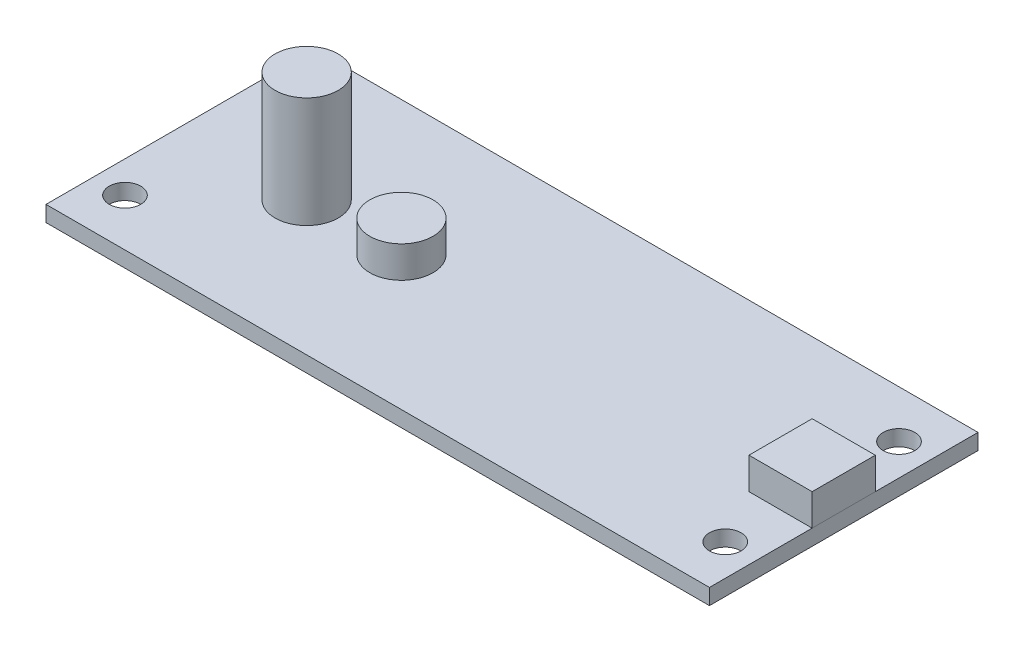
ISO-10303-21;
HEADER;
FILE_DESCRIPTION(('STEP AP214'),'2;1');
FILE_NAME('part.step','',(''),(''),'','','');
FILE_SCHEMA(('AUTOMOTIVE_DESIGN { 1 0 10303 214 1 1 1 1 }'));
ENDSEC;
DATA;
#1=APPLICATION_CONTEXT('core data for automotive mechanical design processes');
#2=APPLICATION_PROTOCOL_DEFINITION('international standard','automotive_design',2000,#1);
#3=PRODUCT_CONTEXT('',#1,'mechanical');
#4=PRODUCT('Part','Part','',(#3));
#5=PRODUCT_RELATED_PRODUCT_CATEGORY('part','',(#4));
#6=PRODUCT_DEFINITION_FORMATION('','',#4);
#7=PRODUCT_DEFINITION_CONTEXT('part definition',#1,'design');
#8=PRODUCT_DEFINITION('design','',#6,#7);
#9=PRODUCT_DEFINITION_SHAPE('','',#8);
#10=(LENGTH_UNIT() NAMED_UNIT(*) SI_UNIT(.MILLI.,.METRE.));
#11=(NAMED_UNIT(*) PLANE_ANGLE_UNIT() SI_UNIT($,.RADIAN.));
#12=(NAMED_UNIT(*) SI_UNIT($,.STERADIAN.) SOLID_ANGLE_UNIT());
#13=UNCERTAINTY_MEASURE_WITH_UNIT(LENGTH_MEASURE(1.E-05),#10,'distance_accuracy_value','');
#14=(GEOMETRIC_REPRESENTATION_CONTEXT(3) GLOBAL_UNCERTAINTY_ASSIGNED_CONTEXT((#13)) GLOBAL_UNIT_ASSIGNED_CONTEXT((#10,
#11,#12)) REPRESENTATION_CONTEXT('',''));
#15=CARTESIAN_POINT('',(0.,0.,0.));
#16=DIRECTION('',(0.,0.,1.));
#17=DIRECTION('',(1.,0.,0.));
#18=AXIS2_PLACEMENT_3D('',#15,#16,#17);
#19=CARTESIAN_POINT('',(-11.1125,4.7625,0.));
#20=DIRECTION('',(0.,-1.,0.));
#21=DIRECTION('',(0.,0.,-1.));
#22=AXIS2_PLACEMENT_3D('',#19,#20,#21);
#23=CYLINDRICAL_SURFACE('',#22,3.175);
#24=CARTESIAN_POINT('',(-11.1125,4.7625,0.));
#25=DIRECTION('',(0.,1.,0.));
#26=DIRECTION('',(0.,0.,1.));
#27=AXIS2_PLACEMENT_3D('',#24,#25,#26);
#28=CIRCLE('',#27,3.175);
#29=CARTESIAN_POINT('',(-11.1125,4.7625,3.175));
#30=VERTEX_POINT('',#29);
#31=EDGE_CURVE('E11',#30,#30,#28,.T.);
#32=ORIENTED_EDGE('',*,*,#31,.F.);
#33=EDGE_LOOP('',(#32));
#34=FACE_BOUND('',#33,.T.);
#35=CARTESIAN_POINT('',(-11.1125,1.5875,0.));
#36=DIRECTION('',(0.,1.,0.));
#37=DIRECTION('',(0.,0.,1.));
#38=AXIS2_PLACEMENT_3D('',#35,#36,#37);
#39=CIRCLE('',#38,3.175);
#40=CARTESIAN_POINT('',(-11.1125,1.5875,3.175));
#41=VERTEX_POINT('',#40);
#42=EDGE_CURVE('E46',#41,#41,#39,.T.);
#43=ORIENTED_EDGE('',*,*,#42,.T.);
#44=EDGE_LOOP('',(#43));
#45=FACE_BOUND('',#44,.T.);
#46=ADVANCED_FACE('F43',(#34,#45),#23,.T.);
#47=CARTESIAN_POINT('',(-11.1125,4.7625,0.));
#48=DIRECTION('',(0.,1.,0.));
#49=DIRECTION('',(0.,0.,1.));
#50=AXIS2_PLACEMENT_3D('',#47,#48,#49);
#51=PLANE('',#50);
#52=ORIENTED_EDGE('',*,*,#31,.T.);
#53=EDGE_LOOP('',(#52));
#54=FACE_BOUND('',#53,.T.);
#55=ADVANCED_FACE('F58',(#54),#51,.T.);
#56=CARTESIAN_POINT('',(-11.1125,1.5875,0.));
#57=DIRECTION('',(0.,1.,0.));
#58=DIRECTION('',(0.,0.,1.));
#59=AXIS2_PLACEMENT_3D('',#56,#57,#58);
#60=PLANE('',#59);
#61=ORIENTED_EDGE('',*,*,#42,.F.);
#62=EDGE_LOOP('',(#61));
#63=FACE_BOUND('',#62,.T.);
#64=ADVANCED_FACE('F56',(#63),#60,.F.);
#65=CLOSED_SHELL('',(#46,#55,#64));
#66=MANIFOLD_SOLID_BREP('B2',#65);
#67=CARTESIAN_POINT('',(33.3375,4.7625,-3.175));
#68=DIRECTION('',(-1.,0.,0.));
#69=DIRECTION('',(0.,0.,1.));
#70=AXIS2_PLACEMENT_3D('',#67,#68,#69);
#71=PLANE('',#70);
#72=DIRECTION('',(0.,0.,-1.));
#73=VECTOR('',#72,1.);
#74=CARTESIAN_POINT('',(33.3375,1.5875,-3.175));
#75=LINE('',#74,#73);
#76=CARTESIAN_POINT('',(33.3375,1.5875,3.175));
#77=VERTEX_POINT('',#76);
#78=CARTESIAN_POINT('',(33.3375,1.5875,-3.175));
#79=VERTEX_POINT('',#78);
#80=EDGE_CURVE('E154',#77,#79,#75,.T.);
#81=ORIENTED_EDGE('',*,*,#80,.T.);
#82=DIRECTION('',(0.,-1.,0.));
#83=VECTOR('',#82,1.);
#84=CARTESIAN_POINT('',(33.3375,4.7625,-3.175));
#85=LINE('',#84,#83);
#86=CARTESIAN_POINT('',(33.3375,4.7625,-3.175));
#87=VERTEX_POINT('',#86);
#88=EDGE_CURVE('E41',#87,#79,#85,.T.);
#89=ORIENTED_EDGE('',*,*,#88,.F.);
#90=DIRECTION('',(0.,0.,-1.));
#91=VECTOR('',#90,1.);
#92=CARTESIAN_POINT('',(33.3375,4.7625,-3.175));
#93=LINE('',#92,#91);
#94=CARTESIAN_POINT('',(33.3375,4.7625,3.175));
#95=VERTEX_POINT('',#94);
#96=EDGE_CURVE('E142',#95,#87,#93,.T.);
#97=ORIENTED_EDGE('',*,*,#96,.F.);
#98=DIRECTION('',(0.,-1.,0.));
#99=VECTOR('',#98,1.);
#100=CARTESIAN_POINT('',(33.3375,4.7625,3.175));
#101=LINE('',#100,#99);
#102=EDGE_CURVE('E150',#95,#77,#101,.T.);
#103=ORIENTED_EDGE('',*,*,#102,.T.);
#104=EDGE_LOOP('',(#81,#89,#97,#103));
#105=FACE_BOUND('',#104,.T.);
#106=ADVANCED_FACE('F91',(#105),#71,.F.);
#107=CARTESIAN_POINT('',(33.3375,4.7625,-3.175));
#108=DIRECTION('',(0.,0.,1.));
#109=DIRECTION('',(1.,0.,0.));
#110=AXIS2_PLACEMENT_3D('',#107,#108,#109);
#111=PLANE('',#110);
#112=DIRECTION('',(-1.,0.,0.));
#113=VECTOR('',#112,1.);
#114=CARTESIAN_POINT('',(33.3375,1.5875,-3.175));
#115=LINE('',#114,#113);
#116=CARTESIAN_POINT('',(26.9875,1.5875,-3.175));
#117=VERTEX_POINT('',#116);
#118=EDGE_CURVE('E146',#79,#117,#115,.T.);
#119=ORIENTED_EDGE('',*,*,#118,.T.);
#120=DIRECTION('',(0.,-1.,0.));
#121=VECTOR('',#120,1.);
#122=CARTESIAN_POINT('',(26.9875,4.7625,-3.175));
#123=LINE('',#122,#121);
#124=CARTESIAN_POINT('',(26.9875,4.7625,-3.175));
#125=VERTEX_POINT('',#124);
#126=EDGE_CURVE('E99',#125,#117,#123,.T.);
#127=ORIENTED_EDGE('',*,*,#126,.F.);
#128=DIRECTION('',(-1.,0.,0.));
#129=VECTOR('',#128,1.);
#130=CARTESIAN_POINT('',(33.3375,4.7625,-3.175));
#131=LINE('',#130,#129);
#132=EDGE_CURVE('E137',#87,#125,#131,.T.);
#133=ORIENTED_EDGE('',*,*,#132,.F.);
#134=ORIENTED_EDGE('',*,*,#88,.T.);
#135=EDGE_LOOP('',(#119,#127,#133,#134));
#136=FACE_BOUND('',#135,.T.);
#137=ADVANCED_FACE('F145',(#136),#111,.F.);
#138=CARTESIAN_POINT('',(26.9875,4.7625,-3.175));
#139=DIRECTION('',(1.,0.,0.));
#140=DIRECTION('',(0.,0.,-1.));
#141=AXIS2_PLACEMENT_3D('',#138,#139,#140);
#142=PLANE('',#141);
#143=DIRECTION('',(0.,0.,1.));
#144=VECTOR('',#143,1.);
#145=CARTESIAN_POINT('',(26.9875,1.5875,-3.175));
#146=LINE('',#145,#144);
#147=CARTESIAN_POINT('',(26.9875,1.5875,3.175));
#148=VERTEX_POINT('',#147);
#149=EDGE_CURVE('E124',#117,#148,#146,.T.);
#150=ORIENTED_EDGE('',*,*,#149,.T.);
#151=DIRECTION('',(0.,-1.,0.));
#152=VECTOR('',#151,1.);
#153=CARTESIAN_POINT('',(26.9875,4.7625,3.175));
#154=LINE('',#153,#152);
#155=CARTESIAN_POINT('',(26.9875,4.7625,3.175));
#156=VERTEX_POINT('',#155);
#157=EDGE_CURVE('E147',#156,#148,#154,.T.);
#158=ORIENTED_EDGE('',*,*,#157,.F.);
#159=DIRECTION('',(0.,0.,1.));
#160=VECTOR('',#159,1.);
#161=CARTESIAN_POINT('',(26.9875,4.7625,-3.175));
#162=LINE('',#161,#160);
#163=EDGE_CURVE('E140',#125,#156,#162,.T.);
#164=ORIENTED_EDGE('',*,*,#163,.F.);
#165=ORIENTED_EDGE('',*,*,#126,.T.);
#166=EDGE_LOOP('',(#150,#158,#164,#165));
#167=FACE_BOUND('',#166,.T.);
#168=ADVANCED_FACE('F148',(#167),#142,.F.);
#169=CARTESIAN_POINT('',(33.3375,4.7625,3.175));
#170=DIRECTION('',(0.,0.,-1.));
#171=DIRECTION('',(-1.,0.,0.));
#172=AXIS2_PLACEMENT_3D('',#169,#170,#171);
#173=PLANE('',#172);
#174=DIRECTION('',(1.,0.,0.));
#175=VECTOR('',#174,1.);
#176=CARTESIAN_POINT('',(33.3375,1.5875,3.175));
#177=LINE('',#176,#175);
#178=EDGE_CURVE('E130',#148,#77,#177,.T.);
#179=ORIENTED_EDGE('',*,*,#178,.T.);
#180=ORIENTED_EDGE('',*,*,#102,.F.);
#181=DIRECTION('',(1.,0.,0.));
#182=VECTOR('',#181,1.);
#183=CARTESIAN_POINT('',(33.3375,4.7625,3.175));
#184=LINE('',#183,#182);
#185=EDGE_CURVE('E107',#156,#95,#184,.T.);
#186=ORIENTED_EDGE('',*,*,#185,.F.);
#187=ORIENTED_EDGE('',*,*,#157,.T.);
#188=EDGE_LOOP('',(#179,#180,#186,#187));
#189=FACE_BOUND('',#188,.T.);
#190=ADVANCED_FACE('F161',(#189),#173,.F.);
#191=CARTESIAN_POINT('',(0.,4.7625,0.));
#192=DIRECTION('',(0.,-1.,0.));
#193=DIRECTION('',(0.,0.,-1.));
#194=AXIS2_PLACEMENT_3D('',#191,#192,#193);
#195=PLANE('',#194);
#196=ORIENTED_EDGE('',*,*,#96,.T.);
#197=ORIENTED_EDGE('',*,*,#132,.T.);
#198=ORIENTED_EDGE('',*,*,#163,.T.);
#199=ORIENTED_EDGE('',*,*,#185,.T.);
#200=EDGE_LOOP('',(#196,#197,#198,#199));
#201=FACE_BOUND('',#200,.T.);
#202=ADVANCED_FACE('F138',(#201),#195,.F.);
#203=CARTESIAN_POINT('',(0.,1.5875,0.));
#204=DIRECTION('',(0.,-1.,0.));
#205=DIRECTION('',(0.,0.,-1.));
#206=AXIS2_PLACEMENT_3D('',#203,#204,#205);
#207=PLANE('',#206);
#208=ORIENTED_EDGE('',*,*,#80,.F.);
#209=ORIENTED_EDGE('',*,*,#178,.F.);
#210=ORIENTED_EDGE('',*,*,#149,.F.);
#211=ORIENTED_EDGE('',*,*,#118,.F.);
#212=EDGE_LOOP('',(#208,#209,#210,#211));
#213=FACE_BOUND('',#212,.T.);
#214=ADVANCED_FACE('F164',(#213),#207,.T.);
#215=CLOSED_SHELL('',(#106,#137,#168,#190,#202,#214));
#216=MANIFOLD_SOLID_BREP('B6',#215);
#217=CARTESIAN_POINT('',(-20.6375,12.7,0.));
#218=DIRECTION('',(0.,-1.,0.));
#219=DIRECTION('',(0.,0.,-1.));
#220=AXIS2_PLACEMENT_3D('',#217,#218,#219);
#221=CYLINDRICAL_SURFACE('',#220,3.175);
#222=CARTESIAN_POINT('',(-20.6375,12.7,0.));
#223=DIRECTION('',(0.,1.,0.));
#224=DIRECTION('',(0.,0.,1.));
#225=AXIS2_PLACEMENT_3D('',#222,#223,#224);
#226=CIRCLE('',#225,3.175);
#227=CARTESIAN_POINT('',(-20.6375,12.7,3.175));
#228=VERTEX_POINT('',#227);
#229=EDGE_CURVE('E90',#228,#228,#226,.T.);
#230=ORIENTED_EDGE('',*,*,#229,.F.);
#231=EDGE_LOOP('',(#230));
#232=FACE_BOUND('',#231,.T.);
#233=CARTESIAN_POINT('',(-20.6375,1.5875,0.));
#234=DIRECTION('',(0.,1.,0.));
#235=DIRECTION('',(0.,0.,1.));
#236=AXIS2_PLACEMENT_3D('',#233,#234,#235);
#237=CIRCLE('',#236,3.175);
#238=CARTESIAN_POINT('',(-20.6375,1.5875,3.175));
#239=VERTEX_POINT('',#238);
#240=EDGE_CURVE('E226',#239,#239,#237,.T.);
#241=ORIENTED_EDGE('',*,*,#240,.T.);
#242=EDGE_LOOP('',(#241));
#243=FACE_BOUND('',#242,.T.);
#244=ADVANCED_FACE('F223',(#232,#243),#221,.T.);
#245=CARTESIAN_POINT('',(0.,12.7,0.));
#246=DIRECTION('',(0.,1.,0.));
#247=DIRECTION('',(0.,0.,1.));
#248=AXIS2_PLACEMENT_3D('',#245,#246,#247);
#249=PLANE('',#248);
#250=ORIENTED_EDGE('',*,*,#229,.T.);
#251=EDGE_LOOP('',(#250));
#252=FACE_BOUND('',#251,.T.);
#253=ADVANCED_FACE('F238',(#252),#249,.T.);
#254=CARTESIAN_POINT('',(0.,1.5875,0.));
#255=DIRECTION('',(0.,1.,0.));
#256=DIRECTION('',(0.,0.,1.));
#257=AXIS2_PLACEMENT_3D('',#254,#255,#256);
#258=PLANE('',#257);
#259=ORIENTED_EDGE('',*,*,#240,.F.);
#260=EDGE_LOOP('',(#259));
#261=FACE_BOUND('',#260,.T.);
#262=ADVANCED_FACE('F236',(#261),#258,.F.);
#263=CLOSED_SHELL('',(#244,#253,#262));
#264=MANIFOLD_SOLID_BREP('B35',#263);
#265=CARTESIAN_POINT('',(33.3375,1.5875,-13.49375));
#266=DIRECTION('',(-1.,0.,0.));
#267=DIRECTION('',(0.,0.,1.));
#268=AXIS2_PLACEMENT_3D('',#265,#266,#267);
#269=PLANE('',#268);
#270=DIRECTION('',(0.,0.,-1.));
#271=VECTOR('',#270,1.);
#272=CARTESIAN_POINT('',(33.3375,0.,-13.49375));
#273=LINE('',#272,#271);
#274=CARTESIAN_POINT('',(33.3375,0.,13.49375));
#275=VERTEX_POINT('',#274);
#276=CARTESIAN_POINT('',(33.3375,0.,-13.49375));
#277=VERTEX_POINT('',#276);
#278=EDGE_CURVE('E326',#275,#277,#273,.T.);
#279=ORIENTED_EDGE('',*,*,#278,.T.);
#280=DIRECTION('',(0.,-1.,0.));
#281=VECTOR('',#280,1.);
#282=CARTESIAN_POINT('',(33.3375,1.5875,-13.49375));
#283=LINE('',#282,#281);
#284=CARTESIAN_POINT('',(33.3375,1.5875,-13.49375));
#285=VERTEX_POINT('',#284);
#286=EDGE_CURVE('E221',#285,#277,#283,.T.);
#287=ORIENTED_EDGE('',*,*,#286,.F.);
#288=DIRECTION('',(0.,0.,-1.));
#289=VECTOR('',#288,1.);
#290=CARTESIAN_POINT('',(33.3375,1.5875,-13.49375));
#291=LINE('',#290,#289);
#292=CARTESIAN_POINT('',(33.3375,1.5875,13.49375));
#293=VERTEX_POINT('',#292);
#294=EDGE_CURVE('E314',#293,#285,#291,.T.);
#295=ORIENTED_EDGE('',*,*,#294,.F.);
#296=DIRECTION('',(0.,-1.,0.));
#297=VECTOR('',#296,1.);
#298=CARTESIAN_POINT('',(33.3375,1.5875,13.49375));
#299=LINE('',#298,#297);
#300=EDGE_CURVE('E322',#293,#275,#299,.T.);
#301=ORIENTED_EDGE('',*,*,#300,.T.);
#302=EDGE_LOOP('',(#279,#287,#295,#301));
#303=FACE_BOUND('',#302,.T.);
#304=ADVANCED_FACE('F263',(#303),#269,.F.);
#305=CARTESIAN_POINT('',(-33.3375,1.5875,-13.49375));
#306=DIRECTION('',(0.,0.,1.));
#307=DIRECTION('',(1.,0.,0.));
#308=AXIS2_PLACEMENT_3D('',#305,#306,#307);
#309=PLANE('',#308);
#310=DIRECTION('',(-1.,0.,0.));
#311=VECTOR('',#310,1.);
#312=CARTESIAN_POINT('',(-33.3375,0.,-13.49375));
#313=LINE('',#312,#311);
#314=CARTESIAN_POINT('',(-33.3375,0.,-13.49375));
#315=VERTEX_POINT('',#314);
#316=EDGE_CURVE('E318',#277,#315,#313,.T.);
#317=ORIENTED_EDGE('',*,*,#316,.T.);
#318=DIRECTION('',(0.,-1.,0.));
#319=VECTOR('',#318,1.);
#320=CARTESIAN_POINT('',(-33.3375,1.5875,-13.49375));
#321=LINE('',#320,#319);
#322=CARTESIAN_POINT('',(-33.3375,1.5875,-13.49375));
#323=VERTEX_POINT('',#322);
#324=EDGE_CURVE('E271',#323,#315,#321,.T.);
#325=ORIENTED_EDGE('',*,*,#324,.F.);
#326=DIRECTION('',(-1.,0.,0.));
#327=VECTOR('',#326,1.);
#328=CARTESIAN_POINT('',(-33.3375,1.5875,-13.49375));
#329=LINE('',#328,#327);
#330=EDGE_CURVE('E309',#285,#323,#329,.T.);
#331=ORIENTED_EDGE('',*,*,#330,.F.);
#332=ORIENTED_EDGE('',*,*,#286,.T.);
#333=EDGE_LOOP('',(#317,#325,#331,#332));
#334=FACE_BOUND('',#333,.T.);
#335=ADVANCED_FACE('F317',(#334),#309,.F.);
#336=CARTESIAN_POINT('',(-33.3375,1.5875,-13.49375));
#337=DIRECTION('',(1.,0.,0.));
#338=DIRECTION('',(0.,0.,-1.));
#339=AXIS2_PLACEMENT_3D('',#336,#337,#338);
#340=PLANE('',#339);
#341=DIRECTION('',(0.,0.,1.));
#342=VECTOR('',#341,1.);
#343=CARTESIAN_POINT('',(-33.3375,0.,-13.49375));
#344=LINE('',#343,#342);
#345=CARTESIAN_POINT('',(-33.3375,0.,13.49375));
#346=VERTEX_POINT('',#345);
#347=EDGE_CURVE('E296',#315,#346,#344,.T.);
#348=ORIENTED_EDGE('',*,*,#347,.T.);
#349=DIRECTION('',(0.,-1.,0.));
#350=VECTOR('',#349,1.);
#351=CARTESIAN_POINT('',(-33.3375,1.5875,13.49375));
#352=LINE('',#351,#350);
#353=CARTESIAN_POINT('',(-33.3375,1.5875,13.49375));
#354=VERTEX_POINT('',#353);
#355=EDGE_CURVE('E319',#354,#346,#352,.T.);
#356=ORIENTED_EDGE('',*,*,#355,.F.);
#357=DIRECTION('',(0.,0.,1.));
#358=VECTOR('',#357,1.);
#359=CARTESIAN_POINT('',(-33.3375,1.5875,-13.49375));
#360=LINE('',#359,#358);
#361=EDGE_CURVE('E312',#323,#354,#360,.T.);
#362=ORIENTED_EDGE('',*,*,#361,.F.);
#363=ORIENTED_EDGE('',*,*,#324,.T.);
#364=EDGE_LOOP('',(#348,#356,#362,#363));
#365=FACE_BOUND('',#364,.T.);
#366=ADVANCED_FACE('F320',(#365),#340,.F.);
#367=CARTESIAN_POINT('',(-33.3375,1.5875,13.49375));
#368=DIRECTION('',(0.,0.,-1.));
#369=DIRECTION('',(-1.,0.,0.));
#370=AXIS2_PLACEMENT_3D('',#367,#368,#369);
#371=PLANE('',#370);
#372=DIRECTION('',(1.,0.,0.));
#373=VECTOR('',#372,1.);
#374=CARTESIAN_POINT('',(-33.3375,0.,13.49375));
#375=LINE('',#374,#373);
#376=EDGE_CURVE('E302',#346,#275,#375,.T.);
#377=ORIENTED_EDGE('',*,*,#376,.T.);
#378=ORIENTED_EDGE('',*,*,#300,.F.);
#379=DIRECTION('',(1.,0.,0.));
#380=VECTOR('',#379,1.);
#381=CARTESIAN_POINT('',(-33.3375,1.5875,13.49375));
#382=LINE('',#381,#380);
#383=EDGE_CURVE('E279',#354,#293,#382,.T.);
#384=ORIENTED_EDGE('',*,*,#383,.F.);
#385=ORIENTED_EDGE('',*,*,#355,.T.);
#386=EDGE_LOOP('',(#377,#378,#384,#385));
#387=FACE_BOUND('',#386,.T.);
#388=ADVANCED_FACE('F334',(#387),#371,.F.);
#389=CARTESIAN_POINT('',(0.,1.5875,0.));
#390=DIRECTION('',(0.,1.,0.));
#391=DIRECTION('',(0.,0.,1.));
#392=AXIS2_PLACEMENT_3D('',#389,#390,#391);
#393=PLANE('',#392);
#394=CARTESIAN_POINT('',(-30.1625,1.5875,8.73125));
#395=DIRECTION('',(0.,1.,0.));
#396=DIRECTION('',(0.,0.,1.));
#397=AXIS2_PLACEMENT_3D('',#394,#395,#396);
#398=CIRCLE('',#397,1.5875);
#399=CARTESIAN_POINT('',(-30.1625,1.5875,10.31875));
#400=VERTEX_POINT('',#399);
#401=EDGE_CURVE('E346',#400,#400,#398,.T.);
#402=ORIENTED_EDGE('',*,*,#401,.F.);
#403=EDGE_LOOP('',(#402));
#404=FACE_BOUND('',#403,.T.);
#405=CARTESIAN_POINT('',(-30.1625,1.5875,-8.73125));
#406=DIRECTION('',(0.,1.,0.));
#407=DIRECTION('',(0.,0.,1.));
#408=AXIS2_PLACEMENT_3D('',#405,#406,#407);
#409=CIRCLE('',#408,1.5875);
#410=CARTESIAN_POINT('',(-30.1625,1.5875,-7.14375));
#411=VERTEX_POINT('',#410);
#412=EDGE_CURVE('E352',#411,#411,#409,.T.);
#413=ORIENTED_EDGE('',*,*,#412,.F.);
#414=EDGE_LOOP('',(#413));
#415=FACE_BOUND('',#414,.T.);
#416=CARTESIAN_POINT('',(30.1625,1.5875,-8.73125));
#417=DIRECTION('',(0.,1.,0.));
#418=DIRECTION('',(0.,0.,1.));
#419=AXIS2_PLACEMENT_3D('',#416,#417,#418);
#420=CIRCLE('',#419,1.5875);
#421=CARTESIAN_POINT('',(30.1625,1.5875,-7.14375));
#422=VERTEX_POINT('',#421);
#423=EDGE_CURVE('E358',#422,#422,#420,.T.);
#424=ORIENTED_EDGE('',*,*,#423,.F.);
#425=EDGE_LOOP('',(#424));
#426=FACE_BOUND('',#425,.T.);
#427=CARTESIAN_POINT('',(30.1625,1.5875,8.73125));
#428=DIRECTION('',(0.,1.,0.));
#429=DIRECTION('',(0.,0.,1.));
#430=AXIS2_PLACEMENT_3D('',#427,#428,#429);
#431=CIRCLE('',#430,1.5875);
#432=CARTESIAN_POINT('',(30.1625,1.5875,10.31875));
#433=VERTEX_POINT('',#432);
#434=EDGE_CURVE('E340',#433,#433,#431,.T.);
#435=ORIENTED_EDGE('',*,*,#434,.F.);
#436=EDGE_LOOP('',(#435));
#437=FACE_BOUND('',#436,.T.);
#438=ORIENTED_EDGE('',*,*,#294,.T.);
#439=ORIENTED_EDGE('',*,*,#330,.T.);
#440=ORIENTED_EDGE('',*,*,#361,.T.);
#441=ORIENTED_EDGE('',*,*,#383,.T.);
#442=EDGE_LOOP('',(#438,#439,#440,#441));
#443=FACE_BOUND('',#442,.T.);
#444=ADVANCED_FACE('F310',(#404,#415,#426,#437,#443),#393,.T.);
#445=CARTESIAN_POINT('',(0.,0.,0.));
#446=DIRECTION('',(0.,1.,0.));
#447=DIRECTION('',(0.,0.,1.));
#448=AXIS2_PLACEMENT_3D('',#445,#446,#447);
#449=PLANE('',#448);
#450=CARTESIAN_POINT('',(-30.1625,0.,8.73125));
#451=DIRECTION('',(0.,1.,0.));
#452=DIRECTION('',(0.,0.,1.));
#453=AXIS2_PLACEMENT_3D('',#450,#451,#452);
#454=CIRCLE('',#453,1.5875);
#455=CARTESIAN_POINT('',(-30.1625,0.,10.31875));
#456=VERTEX_POINT('',#455);
#457=EDGE_CURVE('E349',#456,#456,#454,.T.);
#458=ORIENTED_EDGE('',*,*,#457,.T.);
#459=EDGE_LOOP('',(#458));
#460=FACE_BOUND('',#459,.T.);
#461=CARTESIAN_POINT('',(-30.1625,0.,-8.73125));
#462=DIRECTION('',(0.,1.,0.));
#463=DIRECTION('',(0.,0.,1.));
#464=AXIS2_PLACEMENT_3D('',#461,#462,#463);
#465=CIRCLE('',#464,1.5875);
#466=CARTESIAN_POINT('',(-30.1625,0.,-7.14375));
#467=VERTEX_POINT('',#466);
#468=EDGE_CURVE('E355',#467,#467,#465,.T.);
#469=ORIENTED_EDGE('',*,*,#468,.T.);
#470=EDGE_LOOP('',(#469));
#471=FACE_BOUND('',#470,.T.);
#472=CARTESIAN_POINT('',(30.1625,0.,-8.73125));
#473=DIRECTION('',(0.,1.,0.));
#474=DIRECTION('',(0.,0.,1.));
#475=AXIS2_PLACEMENT_3D('',#472,#473,#474);
#476=CIRCLE('',#475,1.5875);
#477=CARTESIAN_POINT('',(30.1625,0.,-7.14375));
#478=VERTEX_POINT('',#477);
#479=EDGE_CURVE('E343',#478,#478,#476,.T.);
#480=ORIENTED_EDGE('',*,*,#479,.T.);
#481=EDGE_LOOP('',(#480));
#482=FACE_BOUND('',#481,.T.);
#483=CARTESIAN_POINT('',(30.1625,0.,8.73125));
#484=DIRECTION('',(0.,1.,0.));
#485=DIRECTION('',(0.,0.,1.));
#486=AXIS2_PLACEMENT_3D('',#483,#484,#485);
#487=CIRCLE('',#486,1.5875);
#488=CARTESIAN_POINT('',(30.1625,0.,10.31875));
#489=VERTEX_POINT('',#488);
#490=EDGE_CURVE('E329',#489,#489,#487,.T.);
#491=ORIENTED_EDGE('',*,*,#490,.T.);
#492=EDGE_LOOP('',(#491));
#493=FACE_BOUND('',#492,.T.);
#494=ORIENTED_EDGE('',*,*,#278,.F.);
#495=ORIENTED_EDGE('',*,*,#376,.F.);
#496=ORIENTED_EDGE('',*,*,#347,.F.);
#497=ORIENTED_EDGE('',*,*,#316,.F.);
#498=EDGE_LOOP('',(#494,#495,#496,#497));
#499=FACE_BOUND('',#498,.T.);
#500=ADVANCED_FACE('F337',(#460,#471,#482,#493,#499),#449,.F.);
#501=CARTESIAN_POINT('',(30.1625,0.,8.73125));
#502=DIRECTION('',(0.,1.,0.));
#503=DIRECTION('',(0.,0.,1.));
#504=AXIS2_PLACEMENT_3D('',#501,#502,#503);
#505=CYLINDRICAL_SURFACE('',#504,1.5875);
#506=ORIENTED_EDGE('',*,*,#490,.F.);
#507=EDGE_LOOP('',(#506));
#508=FACE_BOUND('',#507,.T.);
#509=ORIENTED_EDGE('',*,*,#434,.T.);
#510=EDGE_LOOP('',(#509));
#511=FACE_BOUND('',#510,.T.);
#512=ADVANCED_FACE('F370',(#508,#511),#505,.F.);
#513=CARTESIAN_POINT('',(30.1625,0.,-8.73125));
#514=DIRECTION('',(0.,1.,0.));
#515=DIRECTION('',(0.,0.,1.));
#516=AXIS2_PLACEMENT_3D('',#513,#514,#515);
#517=CYLINDRICAL_SURFACE('',#516,1.5875);
#518=ORIENTED_EDGE('',*,*,#479,.F.);
#519=EDGE_LOOP('',(#518));
#520=FACE_BOUND('',#519,.T.);
#521=ORIENTED_EDGE('',*,*,#423,.T.);
#522=EDGE_LOOP('',(#521));
#523=FACE_BOUND('',#522,.T.);
#524=ADVANCED_FACE('F366',(#520,#523),#517,.F.);
#525=CARTESIAN_POINT('',(-30.1625,0.,-8.73125));
#526=DIRECTION('',(0.,1.,0.));
#527=DIRECTION('',(0.,0.,1.));
#528=AXIS2_PLACEMENT_3D('',#525,#526,#527);
#529=CYLINDRICAL_SURFACE('',#528,1.5875);
#530=ORIENTED_EDGE('',*,*,#468,.F.);
#531=EDGE_LOOP('',(#530));
#532=FACE_BOUND('',#531,.T.);
#533=ORIENTED_EDGE('',*,*,#412,.T.);
#534=EDGE_LOOP('',(#533));
#535=FACE_BOUND('',#534,.T.);
#536=ADVANCED_FACE('F369',(#532,#535),#529,.F.);
#537=CARTESIAN_POINT('',(-30.1625,0.,8.73125));
#538=DIRECTION('',(0.,1.,0.));
#539=DIRECTION('',(0.,0.,1.));
#540=AXIS2_PLACEMENT_3D('',#537,#538,#539);
#541=CYLINDRICAL_SURFACE('',#540,1.5875);
#542=ORIENTED_EDGE('',*,*,#457,.F.);
#543=EDGE_LOOP('',(#542));
#544=FACE_BOUND('',#543,.T.);
#545=ORIENTED_EDGE('',*,*,#401,.T.);
#546=EDGE_LOOP('',(#545));
#547=FACE_BOUND('',#546,.T.);
#548=ADVANCED_FACE('F431',(#544,#547),#541,.F.);
#549=CLOSED_SHELL('',(#304,#335,#366,#388,#444,#500,#512,#524,#536,#548));
#550=MANIFOLD_SOLID_BREP('B85',#549);
#551=ADVANCED_BREP_SHAPE_REPRESENTATION('',(#18,#66,#216,#264,#550),#14);
#552=SHAPE_DEFINITION_REPRESENTATION(#9,#551);
ENDSEC;
END-ISO-10303-21;
